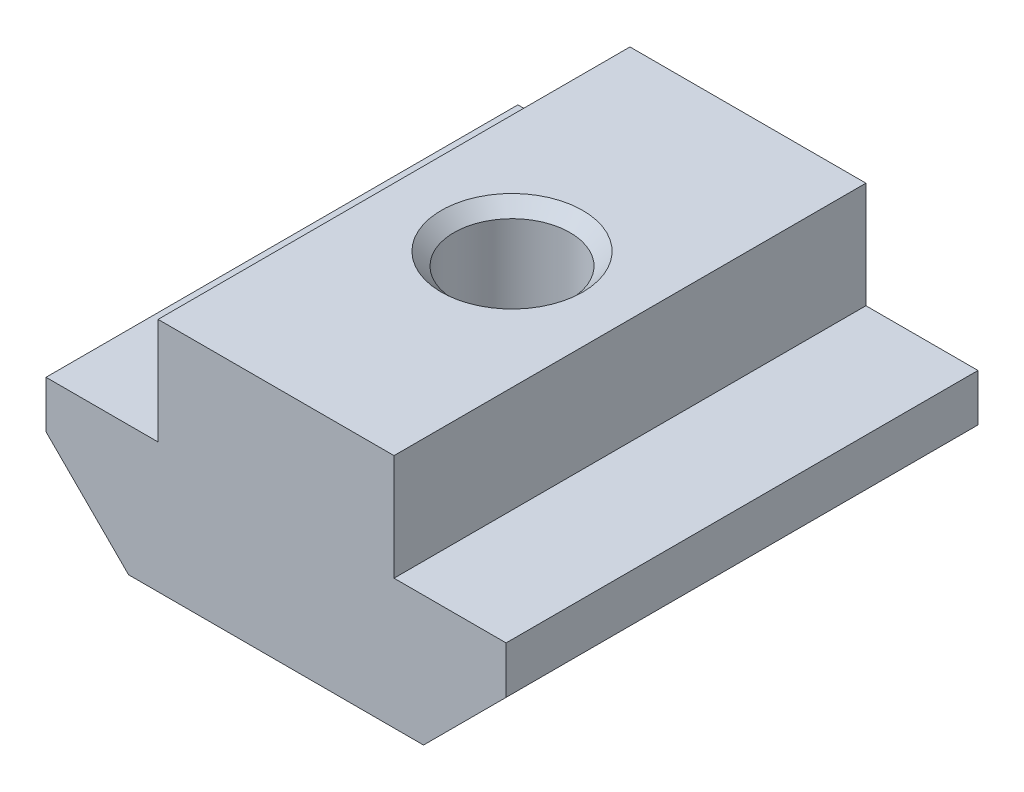
ISO-10303-21;
HEADER;
FILE_DESCRIPTION(('STEP AP214'),'2;1');
FILE_NAME('part.step','',(''),(''),'','','');
FILE_SCHEMA(('AUTOMOTIVE_DESIGN { 1 0 10303 214 1 1 1 1 }'));
ENDSEC;
DATA;
#1=APPLICATION_CONTEXT('core data for automotive mechanical design processes');
#2=APPLICATION_PROTOCOL_DEFINITION('international standard','automotive_design',2000,#1);
#3=PRODUCT_CONTEXT('',#1,'mechanical');
#4=PRODUCT('Part','Part','',(#3));
#5=PRODUCT_RELATED_PRODUCT_CATEGORY('part','',(#4));
#6=PRODUCT_DEFINITION_FORMATION('','',#4);
#7=PRODUCT_DEFINITION_CONTEXT('part definition',#1,'design');
#8=PRODUCT_DEFINITION('design','',#6,#7);
#9=PRODUCT_DEFINITION_SHAPE('','',#8);
#10=(LENGTH_UNIT() NAMED_UNIT(*) SI_UNIT(.MILLI.,.METRE.));
#11=(NAMED_UNIT(*) PLANE_ANGLE_UNIT() SI_UNIT($,.RADIAN.));
#12=(NAMED_UNIT(*) SI_UNIT($,.STERADIAN.) SOLID_ANGLE_UNIT());
#13=UNCERTAINTY_MEASURE_WITH_UNIT(LENGTH_MEASURE(1.E-05),#10,'distance_accuracy_value','');
#14=(GEOMETRIC_REPRESENTATION_CONTEXT(3) GLOBAL_UNCERTAINTY_ASSIGNED_CONTEXT((#13)) GLOBAL_UNIT_ASSIGNED_CONTEXT((#10,
#11,#12)) REPRESENTATION_CONTEXT('',''));
#15=CARTESIAN_POINT('',(0.,0.,0.));
#16=DIRECTION('',(0.,0.,1.));
#17=DIRECTION('',(1.,0.,0.));
#18=AXIS2_PLACEMENT_3D('',#15,#16,#17);
#19=CARTESIAN_POINT('',(-6.25,-5.,10.));
#20=DIRECTION('',(-0.707106781186548,-0.707106781186548,0.));
#21=DIRECTION('',(0.707106781186548,-0.707106781186548,0.));
#22=AXIS2_PLACEMENT_3D('',#19,#20,#21);
#23=PLANE('',#22);
#24=DIRECTION('',(-0.707106781186548,0.707106781186548,0.));
#25=VECTOR('',#24,1.);
#26=CARTESIAN_POINT('',(-6.25,-5.,-10.));
#27=LINE('',#26,#25);
#28=CARTESIAN_POINT('',(-6.25,-5.,-10.));
#29=VERTEX_POINT('',#28);
#30=CARTESIAN_POINT('',(-9.75,-1.5,-10.));
#31=VERTEX_POINT('',#30);
#32=EDGE_CURVE('E147',#29,#31,#27,.T.);
#33=ORIENTED_EDGE('',*,*,#32,.F.);
#34=DIRECTION('',(0.,0.,-1.));
#35=VECTOR('',#34,1.);
#36=CARTESIAN_POINT('',(-6.25,-5.,10.));
#37=LINE('',#36,#35);
#38=CARTESIAN_POINT('',(-6.25,-5.,10.));
#39=VERTEX_POINT('',#38);
#40=EDGE_CURVE('E11',#39,#29,#37,.T.);
#41=ORIENTED_EDGE('',*,*,#40,.F.);
#42=DIRECTION('',(-0.707106781186548,0.707106781186548,0.));
#43=VECTOR('',#42,1.);
#44=CARTESIAN_POINT('',(-6.25,-5.,10.));
#45=LINE('',#44,#43);
#46=CARTESIAN_POINT('',(-9.75,-1.5,10.));
#47=VERTEX_POINT('',#46);
#48=EDGE_CURVE('E138',#39,#47,#45,.T.);
#49=ORIENTED_EDGE('',*,*,#48,.T.);
#50=DIRECTION('',(0.,0.,-1.));
#51=VECTOR('',#50,1.);
#52=CARTESIAN_POINT('',(-9.75,-1.5,10.));
#53=LINE('',#52,#51);
#54=EDGE_CURVE('E35',#47,#31,#53,.T.);
#55=ORIENTED_EDGE('',*,*,#54,.T.);
#56=EDGE_LOOP('',(#33,#41,#49,#55));
#57=FACE_BOUND('',#56,.T.);
#58=ADVANCED_FACE('F32',(#57),#23,.T.);
#59=CARTESIAN_POINT('',(6.25,-5.,10.));
#60=DIRECTION('',(0.,-1.,0.));
#61=DIRECTION('',(1.,0.,0.));
#62=AXIS2_PLACEMENT_3D('',#59,#60,#61);
#63=PLANE('',#62);
#64=CARTESIAN_POINT('',(0.,-5.,0.));
#65=DIRECTION('',(0.,-1.,0.));
#66=DIRECTION('',(1.,0.,0.));
#67=AXIS2_PLACEMENT_3D('',#64,#65,#66);
#68=CIRCLE('',#67,2.9999999999859);
#69=CARTESIAN_POINT('',(2.9999999999859,-5.,0.));
#70=VERTEX_POINT('',#69);
#71=EDGE_CURVE('E209',#70,#70,#68,.T.);
#72=ORIENTED_EDGE('',*,*,#71,.F.);
#73=EDGE_LOOP('',(#72));
#74=FACE_BOUND('',#73,.T.);
#75=DIRECTION('',(-1.,0.,0.));
#76=VECTOR('',#75,1.);
#77=CARTESIAN_POINT('',(6.25,-5.,-10.));
#78=LINE('',#77,#76);
#79=CARTESIAN_POINT('',(6.25,-5.,-10.));
#80=VERTEX_POINT('',#79);
#81=EDGE_CURVE('E160',#80,#29,#78,.T.);
#82=ORIENTED_EDGE('',*,*,#81,.F.);
#83=DIRECTION('',(0.,0.,-1.));
#84=VECTOR('',#83,1.);
#85=CARTESIAN_POINT('',(6.25,-5.,10.));
#86=LINE('',#85,#84);
#87=CARTESIAN_POINT('',(6.25,-5.,10.));
#88=VERTEX_POINT('',#87);
#89=EDGE_CURVE('E40',#88,#80,#86,.T.);
#90=ORIENTED_EDGE('',*,*,#89,.F.);
#91=DIRECTION('',(-1.,0.,0.));
#92=VECTOR('',#91,1.);
#93=CARTESIAN_POINT('',(6.25,-5.,10.));
#94=LINE('',#93,#92);
#95=EDGE_CURVE('E144',#88,#39,#94,.T.);
#96=ORIENTED_EDGE('',*,*,#95,.T.);
#97=ORIENTED_EDGE('',*,*,#40,.T.);
#98=EDGE_LOOP('',(#82,#90,#96,#97));
#99=FACE_BOUND('',#98,.T.);
#100=ADVANCED_FACE('F184',(#74,#99),#63,.T.);
#101=CARTESIAN_POINT('',(9.75,-1.5,10.));
#102=DIRECTION('',(0.707106781186548,-0.707106781186547,0.));
#103=DIRECTION('',(0.707106781186547,0.707106781186548,0.));
#104=AXIS2_PLACEMENT_3D('',#101,#102,#103);
#105=PLANE('',#104);
#106=DIRECTION('',(-0.707106781186547,-0.707106781186548,0.));
#107=VECTOR('',#106,1.);
#108=CARTESIAN_POINT('',(9.75,-1.5,-10.));
#109=LINE('',#108,#107);
#110=CARTESIAN_POINT('',(9.75,-1.5,-10.));
#111=VERTEX_POINT('',#110);
#112=EDGE_CURVE('E157',#111,#80,#109,.T.);
#113=ORIENTED_EDGE('',*,*,#112,.F.);
#114=DIRECTION('',(0.,0.,-1.));
#115=VECTOR('',#114,1.);
#116=CARTESIAN_POINT('',(9.75,-1.5,10.));
#117=LINE('',#116,#115);
#118=CARTESIAN_POINT('',(9.75,-1.5,10.));
#119=VERTEX_POINT('',#118);
#120=EDGE_CURVE('E163',#119,#111,#117,.T.);
#121=ORIENTED_EDGE('',*,*,#120,.F.);
#122=DIRECTION('',(-0.707106781186547,-0.707106781186548,0.));
#123=VECTOR('',#122,1.);
#124=CARTESIAN_POINT('',(9.75,-1.5,10.));
#125=LINE('',#124,#123);
#126=EDGE_CURVE('E135',#119,#88,#125,.T.);
#127=ORIENTED_EDGE('',*,*,#126,.T.);
#128=ORIENTED_EDGE('',*,*,#89,.T.);
#129=EDGE_LOOP('',(#113,#121,#127,#128));
#130=FACE_BOUND('',#129,.T.);
#131=ADVANCED_FACE('F234',(#130),#105,.T.);
#132=CARTESIAN_POINT('',(9.75,5.,10.));
#133=DIRECTION('',(1.,0.,0.));
#134=DIRECTION('',(0.,1.,0.));
#135=AXIS2_PLACEMENT_3D('',#132,#133,#134);
#136=PLANE('',#135);
#137=DIRECTION('',(0.,0.,-1.));
#138=VECTOR('',#137,1.);
#139=CARTESIAN_POINT('',(9.75,0.5,10.));
#140=LINE('',#139,#138);
#141=CARTESIAN_POINT('',(9.75,0.5,10.));
#142=VERTEX_POINT('',#141);
#143=CARTESIAN_POINT('',(9.75,0.5,-10.));
#144=VERTEX_POINT('',#143);
#145=EDGE_CURVE('E56',#142,#144,#140,.T.);
#146=ORIENTED_EDGE('',*,*,#145,.F.);
#147=DIRECTION('',(0.,-1.,0.));
#148=VECTOR('',#147,1.);
#149=CARTESIAN_POINT('',(9.75,5.,10.));
#150=LINE('',#149,#148);
#151=EDGE_CURVE('E132',#142,#119,#150,.T.);
#152=ORIENTED_EDGE('',*,*,#151,.T.);
#153=ORIENTED_EDGE('',*,*,#120,.T.);
#154=DIRECTION('',(0.,-1.,0.));
#155=VECTOR('',#154,1.);
#156=CARTESIAN_POINT('',(9.75,5.,-10.));
#157=LINE('',#156,#155);
#158=EDGE_CURVE('E155',#144,#111,#157,.T.);
#159=ORIENTED_EDGE('',*,*,#158,.F.);
#160=EDGE_LOOP('',(#146,#152,#153,#159));
#161=FACE_BOUND('',#160,.T.);
#162=ADVANCED_FACE('F240',(#161),#136,.T.);
#163=CARTESIAN_POINT('',(-9.75,5.,10.));
#164=DIRECTION('',(0.,1.,0.));
#165=DIRECTION('',(-1.,0.,0.));
#166=AXIS2_PLACEMENT_3D('',#163,#164,#165);
#167=PLANE('',#166);
#168=CARTESIAN_POINT('',(0.,4.99999999995689,0.));
#169=DIRECTION('',(0.,-1.,0.));
#170=DIRECTION('',(1.,0.,0.));
#171=AXIS2_PLACEMENT_3D('',#168,#169,#170);
#172=CIRCLE('',#171,2.99999999996144);
#173=CARTESIAN_POINT('',(2.99999999996144,4.99999999995689,0.));
#174=VERTEX_POINT('',#173);
#175=EDGE_CURVE('E205',#174,#174,#172,.T.);
#176=ORIENTED_EDGE('',*,*,#175,.T.);
#177=EDGE_LOOP('',(#176));
#178=FACE_BOUND('',#177,.T.);
#179=DIRECTION('',(0.,0.,-1.));
#180=VECTOR('',#179,1.);
#181=CARTESIAN_POINT('',(-5.,5.,10.));
#182=LINE('',#181,#180);
#183=CARTESIAN_POINT('',(-5.,5.,10.));
#184=VERTEX_POINT('',#183);
#185=CARTESIAN_POINT('',(-5.,5.,-10.));
#186=VERTEX_POINT('',#185);
#187=EDGE_CURVE('E48',#184,#186,#182,.T.);
#188=ORIENTED_EDGE('',*,*,#187,.F.);
#189=DIRECTION('',(1.,0.,0.));
#190=VECTOR('',#189,1.);
#191=CARTESIAN_POINT('',(-9.75,5.,10.));
#192=LINE('',#191,#190);
#193=CARTESIAN_POINT('',(5.,5.,10.));
#194=VERTEX_POINT('',#193);
#195=EDGE_CURVE('E123',#184,#194,#192,.T.);
#196=ORIENTED_EDGE('',*,*,#195,.T.);
#197=DIRECTION('',(0.,0.,-1.));
#198=VECTOR('',#197,1.);
#199=CARTESIAN_POINT('',(5.,5.,10.));
#200=LINE('',#199,#198);
#201=CARTESIAN_POINT('',(5.,5.,-10.));
#202=VERTEX_POINT('',#201);
#203=EDGE_CURVE('E151',#194,#202,#200,.T.);
#204=ORIENTED_EDGE('',*,*,#203,.T.);
#205=DIRECTION('',(1.,0.,0.));
#206=VECTOR('',#205,1.);
#207=CARTESIAN_POINT('',(-9.75,5.,-10.));
#208=LINE('',#207,#206);
#209=EDGE_CURVE('E125',#186,#202,#208,.T.);
#210=ORIENTED_EDGE('',*,*,#209,.F.);
#211=EDGE_LOOP('',(#188,#196,#204,#210));
#212=FACE_BOUND('',#211,.T.);
#213=ADVANCED_FACE('F121',(#178,#212),#167,.T.);
#214=CARTESIAN_POINT('',(-9.75,-1.5,10.));
#215=DIRECTION('',(-1.,0.,0.));
#216=DIRECTION('',(0.,0.,1.));
#217=AXIS2_PLACEMENT_3D('',#214,#215,#216);
#218=PLANE('',#217);
#219=DIRECTION('',(0.,0.,-1.));
#220=VECTOR('',#219,1.);
#221=CARTESIAN_POINT('',(-9.75,0.5,10.));
#222=LINE('',#221,#220);
#223=CARTESIAN_POINT('',(-9.75,0.5,10.));
#224=VERTEX_POINT('',#223);
#225=CARTESIAN_POINT('',(-9.75,0.5,-10.));
#226=VERTEX_POINT('',#225);
#227=EDGE_CURVE('E178',#224,#226,#222,.T.);
#228=ORIENTED_EDGE('',*,*,#227,.T.);
#229=DIRECTION('',(0.,1.,0.));
#230=VECTOR('',#229,1.);
#231=CARTESIAN_POINT('',(-9.75,-1.5,-10.));
#232=LINE('',#231,#230);
#233=EDGE_CURVE('E150',#31,#226,#232,.T.);
#234=ORIENTED_EDGE('',*,*,#233,.F.);
#235=ORIENTED_EDGE('',*,*,#54,.F.);
#236=DIRECTION('',(0.,1.,0.));
#237=VECTOR('',#236,1.);
#238=CARTESIAN_POINT('',(-9.75,-1.5,10.));
#239=LINE('',#238,#237);
#240=EDGE_CURVE('E133',#47,#224,#239,.T.);
#241=ORIENTED_EDGE('',*,*,#240,.T.);
#242=EDGE_LOOP('',(#228,#234,#235,#241));
#243=FACE_BOUND('',#242,.T.);
#244=ADVANCED_FACE('F177',(#243),#218,.T.);
#245=CARTESIAN_POINT('',(0.,0.,10.));
#246=DIRECTION('',(0.,0.,1.));
#247=DIRECTION('',(1.,0.,0.));
#248=AXIS2_PLACEMENT_3D('',#245,#246,#247);
#249=PLANE('',#248);
#250=DIRECTION('',(-1.,0.,0.));
#251=VECTOR('',#250,1.);
#252=CARTESIAN_POINT('',(-5.,0.5,10.));
#253=LINE('',#252,#251);
#254=CARTESIAN_POINT('',(-5.,0.5,10.));
#255=VERTEX_POINT('',#254);
#256=EDGE_CURVE('E116',#255,#224,#253,.T.);
#257=ORIENTED_EDGE('',*,*,#256,.T.);
#258=ORIENTED_EDGE('',*,*,#240,.F.);
#259=ORIENTED_EDGE('',*,*,#48,.F.);
#260=ORIENTED_EDGE('',*,*,#95,.F.);
#261=ORIENTED_EDGE('',*,*,#126,.F.);
#262=ORIENTED_EDGE('',*,*,#151,.F.);
#263=DIRECTION('',(-1.,0.,0.));
#264=VECTOR('',#263,1.);
#265=CARTESIAN_POINT('',(9.75,0.5,10.));
#266=LINE('',#265,#264);
#267=CARTESIAN_POINT('',(5.,0.5,10.));
#268=VERTEX_POINT('',#267);
#269=EDGE_CURVE('E195',#142,#268,#266,.T.);
#270=ORIENTED_EDGE('',*,*,#269,.T.);
#271=DIRECTION('',(0.,1.,0.));
#272=VECTOR('',#271,1.);
#273=CARTESIAN_POINT('',(5.,0.5,10.));
#274=LINE('',#273,#272);
#275=EDGE_CURVE('E131',#268,#194,#274,.T.);
#276=ORIENTED_EDGE('',*,*,#275,.T.);
#277=ORIENTED_EDGE('',*,*,#195,.F.);
#278=DIRECTION('',(0.,-1.,0.));
#279=VECTOR('',#278,1.);
#280=CARTESIAN_POINT('',(-5.,5.,10.));
#281=LINE('',#280,#279);
#282=EDGE_CURVE('E109',#184,#255,#281,.T.);
#283=ORIENTED_EDGE('',*,*,#282,.T.);
#284=EDGE_LOOP('',(#257,#258,#259,#260,#261,#262,#270,#276,#277,#283));
#285=FACE_BOUND('',#284,.T.);
#286=ADVANCED_FACE('F128',(#285),#249,.T.);
#287=CARTESIAN_POINT('',(0.,0.,-10.));
#288=DIRECTION('',(0.,0.,1.));
#289=DIRECTION('',(1.,0.,0.));
#290=AXIS2_PLACEMENT_3D('',#287,#288,#289);
#291=PLANE('',#290);
#292=ORIENTED_EDGE('',*,*,#233,.T.);
#293=DIRECTION('',(-1.,0.,0.));
#294=VECTOR('',#293,1.);
#295=CARTESIAN_POINT('',(-5.,0.5,-10.));
#296=LINE('',#295,#294);
#297=CARTESIAN_POINT('',(-5.,0.5,-10.));
#298=VERTEX_POINT('',#297);
#299=EDGE_CURVE('E117',#298,#226,#296,.T.);
#300=ORIENTED_EDGE('',*,*,#299,.F.);
#301=DIRECTION('',(0.,-1.,0.));
#302=VECTOR('',#301,1.);
#303=CARTESIAN_POINT('',(-5.,5.,-10.));
#304=LINE('',#303,#302);
#305=EDGE_CURVE('E203',#186,#298,#304,.T.);
#306=ORIENTED_EDGE('',*,*,#305,.F.);
#307=ORIENTED_EDGE('',*,*,#209,.T.);
#308=DIRECTION('',(0.,1.,0.));
#309=VECTOR('',#308,1.);
#310=CARTESIAN_POINT('',(5.,0.5,-10.));
#311=LINE('',#310,#309);
#312=CARTESIAN_POINT('',(5.,0.5,-10.));
#313=VERTEX_POINT('',#312);
#314=EDGE_CURVE('E192',#313,#202,#311,.T.);
#315=ORIENTED_EDGE('',*,*,#314,.F.);
#316=DIRECTION('',(-1.,0.,0.));
#317=VECTOR('',#316,1.);
#318=CARTESIAN_POINT('',(9.75,0.5,-10.));
#319=LINE('',#318,#317);
#320=EDGE_CURVE('E196',#144,#313,#319,.T.);
#321=ORIENTED_EDGE('',*,*,#320,.F.);
#322=ORIENTED_EDGE('',*,*,#158,.T.);
#323=ORIENTED_EDGE('',*,*,#112,.T.);
#324=ORIENTED_EDGE('',*,*,#81,.T.);
#325=ORIENTED_EDGE('',*,*,#32,.T.);
#326=EDGE_LOOP('',(#292,#300,#306,#307,#315,#321,#322,#323,#324,#325));
#327=FACE_BOUND('',#326,.T.);
#328=ADVANCED_FACE('F181',(#327),#291,.F.);
#329=CARTESIAN_POINT('',(5.,0.5,10.));
#330=DIRECTION('',(-1.,0.,0.));
#331=DIRECTION('',(0.,0.,1.));
#332=AXIS2_PLACEMENT_3D('',#329,#330,#331);
#333=PLANE('',#332);
#334=ORIENTED_EDGE('',*,*,#314,.T.);
#335=ORIENTED_EDGE('',*,*,#203,.F.);
#336=ORIENTED_EDGE('',*,*,#275,.F.);
#337=DIRECTION('',(0.,0.,-1.));
#338=VECTOR('',#337,1.);
#339=CARTESIAN_POINT('',(5.,0.5,10.));
#340=LINE('',#339,#338);
#341=EDGE_CURVE('E189',#268,#313,#340,.T.);
#342=ORIENTED_EDGE('',*,*,#341,.T.);
#343=EDGE_LOOP('',(#334,#335,#336,#342));
#344=FACE_BOUND('',#343,.T.);
#345=ADVANCED_FACE('F257',(#344),#333,.F.);
#346=CARTESIAN_POINT('',(9.75,0.5,10.));
#347=DIRECTION('',(0.,-1.,0.));
#348=DIRECTION('',(0.,0.,-1.));
#349=AXIS2_PLACEMENT_3D('',#346,#347,#348);
#350=PLANE('',#349);
#351=ORIENTED_EDGE('',*,*,#320,.T.);
#352=ORIENTED_EDGE('',*,*,#341,.F.);
#353=ORIENTED_EDGE('',*,*,#269,.F.);
#354=ORIENTED_EDGE('',*,*,#145,.T.);
#355=EDGE_LOOP('',(#351,#352,#353,#354));
#356=FACE_BOUND('',#355,.T.);
#357=ADVANCED_FACE('F259',(#356),#350,.F.);
#358=CARTESIAN_POINT('',(-5.,0.5,10.));
#359=DIRECTION('',(0.,-1.,0.));
#360=DIRECTION('',(1.,0.,0.));
#361=AXIS2_PLACEMENT_3D('',#358,#359,#360);
#362=PLANE('',#361);
#363=ORIENTED_EDGE('',*,*,#299,.T.);
#364=ORIENTED_EDGE('',*,*,#227,.F.);
#365=ORIENTED_EDGE('',*,*,#256,.F.);
#366=DIRECTION('',(0.,0.,-1.));
#367=VECTOR('',#366,1.);
#368=CARTESIAN_POINT('',(-5.,0.5,10.));
#369=LINE('',#368,#367);
#370=EDGE_CURVE('E111',#255,#298,#369,.T.);
#371=ORIENTED_EDGE('',*,*,#370,.T.);
#372=EDGE_LOOP('',(#363,#364,#365,#371));
#373=FACE_BOUND('',#372,.T.);
#374=ADVANCED_FACE('F262',(#373),#362,.F.);
#375=CARTESIAN_POINT('',(-5.,5.,10.));
#376=DIRECTION('',(1.,0.,0.));
#377=DIRECTION('',(0.,0.,-1.));
#378=AXIS2_PLACEMENT_3D('',#375,#376,#377);
#379=PLANE('',#378);
#380=ORIENTED_EDGE('',*,*,#305,.T.);
#381=ORIENTED_EDGE('',*,*,#370,.F.);
#382=ORIENTED_EDGE('',*,*,#282,.F.);
#383=ORIENTED_EDGE('',*,*,#187,.T.);
#384=EDGE_LOOP('',(#380,#381,#382,#383));
#385=FACE_BOUND('',#384,.T.);
#386=ADVANCED_FACE('F110',(#385),#379,.F.);
#387=CARTESIAN_POINT('',(0.,4.45849999996144,0.));
#388=DIRECTION('',(0.,1.,0.));
#389=DIRECTION('',(-1.,0.,0.));
#390=AXIS2_PLACEMENT_3D('',#387,#388,#389);
#391=CONICAL_SURFACE('',#390,2.45849999996599,0.785398163397448);
#392=ORIENTED_EDGE('',*,*,#175,.F.);
#393=EDGE_LOOP('',(#392));
#394=FACE_BOUND('',#393,.T.);
#395=CARTESIAN_POINT('',(0.,4.45849999996144,0.));
#396=DIRECTION('',(0.,-1.,0.));
#397=DIRECTION('',(1.,0.,0.));
#398=AXIS2_PLACEMENT_3D('',#395,#396,#397);
#399=CIRCLE('',#398,2.45849999996599);
#400=CARTESIAN_POINT('',(2.45849999996599,4.45849999996144,0.));
#401=VERTEX_POINT('',#400);
#402=EDGE_CURVE('E215',#401,#401,#399,.T.);
#403=ORIENTED_EDGE('',*,*,#402,.T.);
#404=EDGE_LOOP('',(#403));
#405=FACE_BOUND('',#404,.T.);
#406=ADVANCED_FACE('F219',(#394,#405),#391,.F.);
#407=CARTESIAN_POINT('',(0.,-5.,0.));
#408=DIRECTION('',(0.,-1.,0.));
#409=DIRECTION('',(1.,0.,0.));
#410=AXIS2_PLACEMENT_3D('',#407,#408,#409);
#411=CONICAL_SURFACE('',#410,2.9999999999859,0.78539816339745);
#412=CARTESIAN_POINT('',(0.,-4.45849999998008,0.));
#413=DIRECTION('',(0.,-1.,0.));
#414=DIRECTION('',(1.,0.,0.));
#415=AXIS2_PLACEMENT_3D('',#412,#413,#414);
#416=CIRCLE('',#415,2.45849999996599);
#417=CARTESIAN_POINT('',(2.45849999996599,-4.45849999998008,0.));
#418=VERTEX_POINT('',#417);
#419=EDGE_CURVE('E212',#418,#418,#416,.T.);
#420=ORIENTED_EDGE('',*,*,#419,.F.);
#421=EDGE_LOOP('',(#420));
#422=FACE_BOUND('',#421,.T.);
#423=ORIENTED_EDGE('',*,*,#71,.T.);
#424=EDGE_LOOP('',(#423));
#425=FACE_BOUND('',#424,.T.);
#426=ADVANCED_FACE('F224',(#422,#425),#411,.F.);
#427=CARTESIAN_POINT('',(0.,4.99999999995689,0.));
#428=DIRECTION('',(0.,-1.,0.));
#429=DIRECTION('',(1.,0.,0.));
#430=AXIS2_PLACEMENT_3D('',#427,#428,#429);
#431=CYLINDRICAL_SURFACE('',#430,2.45849999996599);
#432=ORIENTED_EDGE('',*,*,#402,.F.);
#433=EDGE_LOOP('',(#432));
#434=FACE_BOUND('',#433,.T.);
#435=ORIENTED_EDGE('',*,*,#419,.T.);
#436=EDGE_LOOP('',(#435));
#437=FACE_BOUND('',#436,.T.);
#438=ADVANCED_FACE('F221',(#434,#437),#431,.F.);
#439=CLOSED_SHELL('',(#58,#100,#131,#162,#213,#244,#286,#328,#345,#357,#374,#386,#406,#426,#438));
#440=MANIFOLD_SOLID_BREP('B2',#439);
#441=ADVANCED_BREP_SHAPE_REPRESENTATION('',(#18,#440),#14);
#442=SHAPE_DEFINITION_REPRESENTATION(#9,#441);
ENDSEC;
END-ISO-10303-21;
